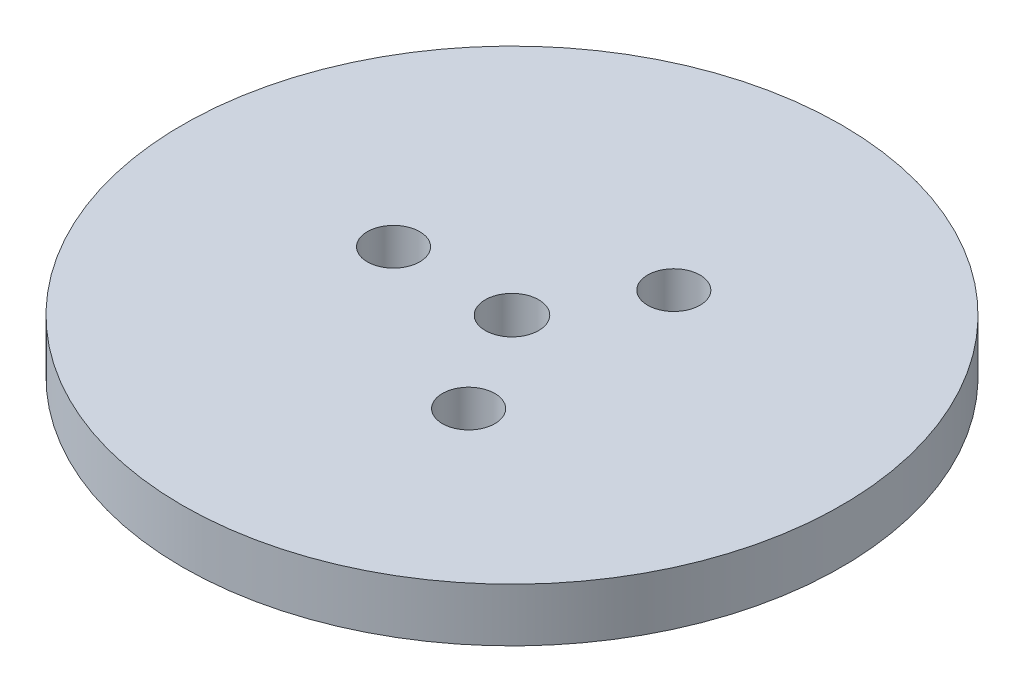
ISO-10303-21;
HEADER;
FILE_DESCRIPTION(('STEP AP214'),'2;1');
FILE_NAME('part.step','',(''),(''),'','','');
FILE_SCHEMA(('AUTOMOTIVE_DESIGN { 1 0 10303 214 1 1 1 1 }'));
ENDSEC;
DATA;
#1=APPLICATION_CONTEXT('core data for automotive mechanical design processes');
#2=APPLICATION_PROTOCOL_DEFINITION('international standard','automotive_design',2000,#1);
#3=PRODUCT_CONTEXT('',#1,'mechanical');
#4=PRODUCT('Part','Part','',(#3));
#5=PRODUCT_RELATED_PRODUCT_CATEGORY('part','',(#4));
#6=PRODUCT_DEFINITION_FORMATION('','',#4);
#7=PRODUCT_DEFINITION_CONTEXT('part definition',#1,'design');
#8=PRODUCT_DEFINITION('design','',#6,#7);
#9=PRODUCT_DEFINITION_SHAPE('','',#8);
#10=(LENGTH_UNIT() NAMED_UNIT(*) SI_UNIT(.MILLI.,.METRE.));
#11=(NAMED_UNIT(*) PLANE_ANGLE_UNIT() SI_UNIT($,.RADIAN.));
#12=(NAMED_UNIT(*) SI_UNIT($,.STERADIAN.) SOLID_ANGLE_UNIT());
#13=UNCERTAINTY_MEASURE_WITH_UNIT(LENGTH_MEASURE(1.E-05),#10,'distance_accuracy_value','');
#14=(GEOMETRIC_REPRESENTATION_CONTEXT(3) GLOBAL_UNCERTAINTY_ASSIGNED_CONTEXT((#13)) GLOBAL_UNIT_ASSIGNED_CONTEXT((#10,
#11,#12)) REPRESENTATION_CONTEXT('',''));
#15=CARTESIAN_POINT('',(0.,0.,0.));
#16=DIRECTION('',(0.,0.,1.));
#17=DIRECTION('',(1.,0.,0.));
#18=AXIS2_PLACEMENT_3D('',#15,#16,#17);
#19=CARTESIAN_POINT('',(0.,15.,0.));
#20=DIRECTION('',(0.,-1.,0.));
#21=DIRECTION('',(0.,0.,-1.));
#22=AXIS2_PLACEMENT_3D('',#19,#20,#21);
#23=CYLINDRICAL_SURFACE('',#22,92.5);
#24=CARTESIAN_POINT('',(0.,15.,0.));
#25=DIRECTION('',(0.,1.,0.));
#26=DIRECTION('',(0.,0.,1.));
#27=AXIS2_PLACEMENT_3D('',#24,#25,#26);
#28=CIRCLE('',#27,92.5);
#29=CARTESIAN_POINT('',(0.,15.,92.5));
#30=VERTEX_POINT('',#29);
#31=EDGE_CURVE('E10',#30,#30,#28,.T.);
#32=ORIENTED_EDGE('',*,*,#31,.F.);
#33=EDGE_LOOP('',(#32));
#34=FACE_BOUND('',#33,.T.);
#35=CARTESIAN_POINT('',(0.,0.,0.));
#36=DIRECTION('',(0.,1.,0.));
#37=DIRECTION('',(0.,0.,1.));
#38=AXIS2_PLACEMENT_3D('',#35,#36,#37);
#39=CIRCLE('',#38,92.5);
#40=CARTESIAN_POINT('',(0.,0.,92.5));
#41=VERTEX_POINT('',#40);
#42=EDGE_CURVE('E37',#41,#41,#39,.T.);
#43=ORIENTED_EDGE('',*,*,#42,.T.);
#44=EDGE_LOOP('',(#43));
#45=FACE_BOUND('',#44,.T.);
#46=ADVANCED_FACE('F40',(#34,#45),#23,.T.);
#47=CARTESIAN_POINT('',(0.,15.,0.));
#48=DIRECTION('',(0.,1.,0.));
#49=DIRECTION('',(0.,0.,1.));
#50=AXIS2_PLACEMENT_3D('',#47,#48,#49);
#51=PLANE('',#50);
#52=CARTESIAN_POINT('',(16.6234212252094,15.,28.7926101576812));
#53=DIRECTION('',(0.,1.,0.));
#54=DIRECTION('',(0.866025403784436,0.,-0.500000000000004));
#55=AXIS2_PLACEMENT_3D('',#52,#53,#54);
#56=CIRCLE('',#55,7.35693712118464);
#57=CARTESIAN_POINT('',(22.9947156662,15.,25.1141415970889));
#58=VERTEX_POINT('',#57);
#59=EDGE_CURVE('E70',#58,#58,#56,.T.);
#60=ORIENTED_EDGE('',*,*,#59,.F.);
#61=EDGE_LOOP('',(#60));
#62=FACE_BOUND('',#61,.T.);
#63=CARTESIAN_POINT('',(16.623421225209,15.,-28.7926101576815));
#64=DIRECTION('',(0.,1.,0.));
#65=DIRECTION('',(-0.866025403784443,0.,-0.499999999999992));
#66=AXIS2_PLACEMENT_3D('',#63,#64,#65);
#67=CIRCLE('',#66,7.35693712118464);
#68=CARTESIAN_POINT('',(10.2521267842183,15.,-32.4710787182737));
#69=VERTEX_POINT('',#68);
#70=EDGE_CURVE('E61',#69,#69,#67,.T.);
#71=ORIENTED_EDGE('',*,*,#70,.F.);
#72=EDGE_LOOP('',(#71));
#73=FACE_BOUND('',#72,.T.);
#74=CARTESIAN_POINT('',(-33.2468424504185,15.,0.));
#75=DIRECTION('',(0.,1.,0.));
#76=DIRECTION('',(0.,0.,1.));
#77=AXIS2_PLACEMENT_3D('',#74,#75,#76);
#78=CIRCLE('',#77,7.35693712118464);
#79=CARTESIAN_POINT('',(-33.2468424504185,15.,7.35693712118464));
#80=VERTEX_POINT('',#79);
#81=EDGE_CURVE('E54',#80,#80,#78,.T.);
#82=ORIENTED_EDGE('',*,*,#81,.F.);
#83=EDGE_LOOP('',(#82));
#84=FACE_BOUND('',#83,.T.);
#85=CARTESIAN_POINT('',(0.,15.,0.));
#86=DIRECTION('',(0.,1.,0.));
#87=DIRECTION('',(0.,0.,1.));
#88=AXIS2_PLACEMENT_3D('',#85,#86,#87);
#89=CIRCLE('',#88,7.5);
#90=CARTESIAN_POINT('',(0.,15.,7.5));
#91=VERTEX_POINT('',#90);
#92=EDGE_CURVE('E50',#91,#91,#89,.T.);
#93=ORIENTED_EDGE('',*,*,#92,.F.);
#94=EDGE_LOOP('',(#93));
#95=FACE_BOUND('',#94,.T.);
#96=ORIENTED_EDGE('',*,*,#31,.T.);
#97=EDGE_LOOP('',(#96));
#98=FACE_BOUND('',#97,.T.);
#99=ADVANCED_FACE('F85',(#62,#73,#84,#95,#98),#51,.T.);
#100=CARTESIAN_POINT('',(0.,0.,0.));
#101=DIRECTION('',(0.,1.,0.));
#102=DIRECTION('',(0.,0.,1.));
#103=AXIS2_PLACEMENT_3D('',#100,#101,#102);
#104=PLANE('',#103);
#105=CARTESIAN_POINT('',(0.,0.,0.));
#106=DIRECTION('',(0.,1.,0.));
#107=DIRECTION('',(0.,0.,1.));
#108=AXIS2_PLACEMENT_3D('',#105,#106,#107);
#109=CIRCLE('',#108,7.5);
#110=CARTESIAN_POINT('',(0.,0.,7.5));
#111=VERTEX_POINT('',#110);
#112=EDGE_CURVE('E47',#111,#111,#109,.T.);
#113=ORIENTED_EDGE('',*,*,#112,.T.);
#114=EDGE_LOOP('',(#113));
#115=FACE_BOUND('',#114,.T.);
#116=ORIENTED_EDGE('',*,*,#42,.F.);
#117=EDGE_LOOP('',(#116));
#118=FACE_BOUND('',#117,.T.);
#119=ADVANCED_FACE('F84',(#115,#118),#104,.F.);
#120=CARTESIAN_POINT('',(0.,15.,0.));
#121=DIRECTION('',(0.,-1.,0.));
#122=DIRECTION('',(0.,0.,-1.));
#123=AXIS2_PLACEMENT_3D('',#120,#121,#122);
#124=CYLINDRICAL_SURFACE('',#123,7.5);
#125=ORIENTED_EDGE('',*,*,#92,.T.);
#126=EDGE_LOOP('',(#125));
#127=FACE_BOUND('',#126,.T.);
#128=ORIENTED_EDGE('',*,*,#112,.F.);
#129=EDGE_LOOP('',(#128));
#130=FACE_BOUND('',#129,.T.);
#131=ADVANCED_FACE('F91',(#127,#130),#124,.F.);
#132=CARTESIAN_POINT('',(-33.2468424504185,0.724315711387681,0.));
#133=DIRECTION('',(0.,1.,0.));
#134=DIRECTION('',(0.,0.,1.));
#135=AXIS2_PLACEMENT_3D('',#132,#133,#134);
#136=CYLINDRICAL_SURFACE('',#135,7.35693712118464);
#137=CARTESIAN_POINT('',(-33.2468424504185,0.724315711387681,0.));
#138=DIRECTION('',(0.,1.,0.));
#139=DIRECTION('',(0.,0.,1.));
#140=AXIS2_PLACEMENT_3D('',#137,#138,#139);
#141=CIRCLE('',#140,7.35693712118464);
#142=CARTESIAN_POINT('',(-33.2468424504185,0.724315711387681,7.35693712118464));
#143=VERTEX_POINT('',#142);
#144=EDGE_CURVE('E55',#143,#143,#141,.T.);
#145=ORIENTED_EDGE('',*,*,#144,.F.);
#146=EDGE_LOOP('',(#145));
#147=FACE_BOUND('',#146,.T.);
#148=ORIENTED_EDGE('',*,*,#81,.T.);
#149=EDGE_LOOP('',(#148));
#150=FACE_BOUND('',#149,.T.);
#151=ADVANCED_FACE('F96',(#147,#150),#136,.F.);
#152=CARTESIAN_POINT('',(-33.2468424504185,0.724315711387681,0.));
#153=DIRECTION('',(0.,1.,0.));
#154=DIRECTION('',(0.,0.,1.));
#155=AXIS2_PLACEMENT_3D('',#152,#153,#154);
#156=PLANE('',#155);
#157=ORIENTED_EDGE('',*,*,#144,.T.);
#158=EDGE_LOOP('',(#157));
#159=FACE_BOUND('',#158,.T.);
#160=ADVANCED_FACE('F127',(#159),#156,.T.);
#161=CARTESIAN_POINT('',(16.623421225209,0.724315711387681,-28.7926101576815));
#162=DIRECTION('',(0.,1.,0.));
#163=DIRECTION('',(0.,0.,1.));
#164=AXIS2_PLACEMENT_3D('',#161,#162,#163);
#165=CYLINDRICAL_SURFACE('',#164,7.35693712118464);
#166=CARTESIAN_POINT('',(16.623421225209,0.724315711387681,-28.7926101576815));
#167=DIRECTION('',(0.,1.,0.));
#168=DIRECTION('',(-0.866025403784443,0.,-0.499999999999992));
#169=AXIS2_PLACEMENT_3D('',#166,#167,#168);
#170=CIRCLE('',#169,7.35693712118464);
#171=CARTESIAN_POINT('',(10.2521267842183,0.724315711387681,-32.4710787182737));
#172=VERTEX_POINT('',#171);
#173=EDGE_CURVE('E63',#172,#172,#170,.T.);
#174=ORIENTED_EDGE('',*,*,#173,.F.);
#175=EDGE_LOOP('',(#174));
#176=FACE_BOUND('',#175,.T.);
#177=ORIENTED_EDGE('',*,*,#70,.T.);
#178=EDGE_LOOP('',(#177));
#179=FACE_BOUND('',#178,.T.);
#180=ADVANCED_FACE('F133',(#176,#179),#165,.F.);
#181=CARTESIAN_POINT('',(16.623421225209,0.724315711387681,-28.7926101576815));
#182=DIRECTION('',(0.,1.,0.));
#183=DIRECTION('',(-0.866025403784443,0.,-0.499999999999992));
#184=AXIS2_PLACEMENT_3D('',#181,#182,#183);
#185=PLANE('',#184);
#186=ORIENTED_EDGE('',*,*,#173,.T.);
#187=EDGE_LOOP('',(#186));
#188=FACE_BOUND('',#187,.T.);
#189=ADVANCED_FACE('F77',(#188),#185,.T.);
#190=CARTESIAN_POINT('',(16.6234212252094,0.724315711387681,28.7926101576812));
#191=DIRECTION('',(0.,1.,0.));
#192=DIRECTION('',(0.,0.,1.));
#193=AXIS2_PLACEMENT_3D('',#190,#191,#192);
#194=CYLINDRICAL_SURFACE('',#193,7.35693712118464);
#195=CARTESIAN_POINT('',(16.6234212252094,0.724315711387681,28.7926101576812));
#196=DIRECTION('',(0.,1.,0.));
#197=DIRECTION('',(0.866025403784436,0.,-0.500000000000004));
#198=AXIS2_PLACEMENT_3D('',#195,#196,#197);
#199=CIRCLE('',#198,7.35693712118464);
#200=CARTESIAN_POINT('',(22.9947156662,0.724315711387681,25.1141415970889));
#201=VERTEX_POINT('',#200);
#202=EDGE_CURVE('E59',#201,#201,#199,.T.);
#203=ORIENTED_EDGE('',*,*,#202,.F.);
#204=EDGE_LOOP('',(#203));
#205=FACE_BOUND('',#204,.T.);
#206=ORIENTED_EDGE('',*,*,#59,.T.);
#207=EDGE_LOOP('',(#206));
#208=FACE_BOUND('',#207,.T.);
#209=ADVANCED_FACE('F73',(#205,#208),#194,.F.);
#210=CARTESIAN_POINT('',(16.6234212252094,0.724315711387681,28.7926101576812));
#211=DIRECTION('',(0.,1.,0.));
#212=DIRECTION('',(0.866025403784436,0.,-0.500000000000004));
#213=AXIS2_PLACEMENT_3D('',#210,#211,#212);
#214=PLANE('',#213);
#215=ORIENTED_EDGE('',*,*,#202,.T.);
#216=EDGE_LOOP('',(#215));
#217=FACE_BOUND('',#216,.T.);
#218=ADVANCED_FACE('F71',(#217),#214,.T.);
#219=CLOSED_SHELL('',(#46,#99,#119,#131,#151,#160,#180,#189,#209,#218));
#220=MANIFOLD_SOLID_BREP('B2',#219);
#221=ADVANCED_BREP_SHAPE_REPRESENTATION('',(#18,#220),#14);
#222=SHAPE_DEFINITION_REPRESENTATION(#9,#221);
ENDSEC;
END-ISO-10303-21;
